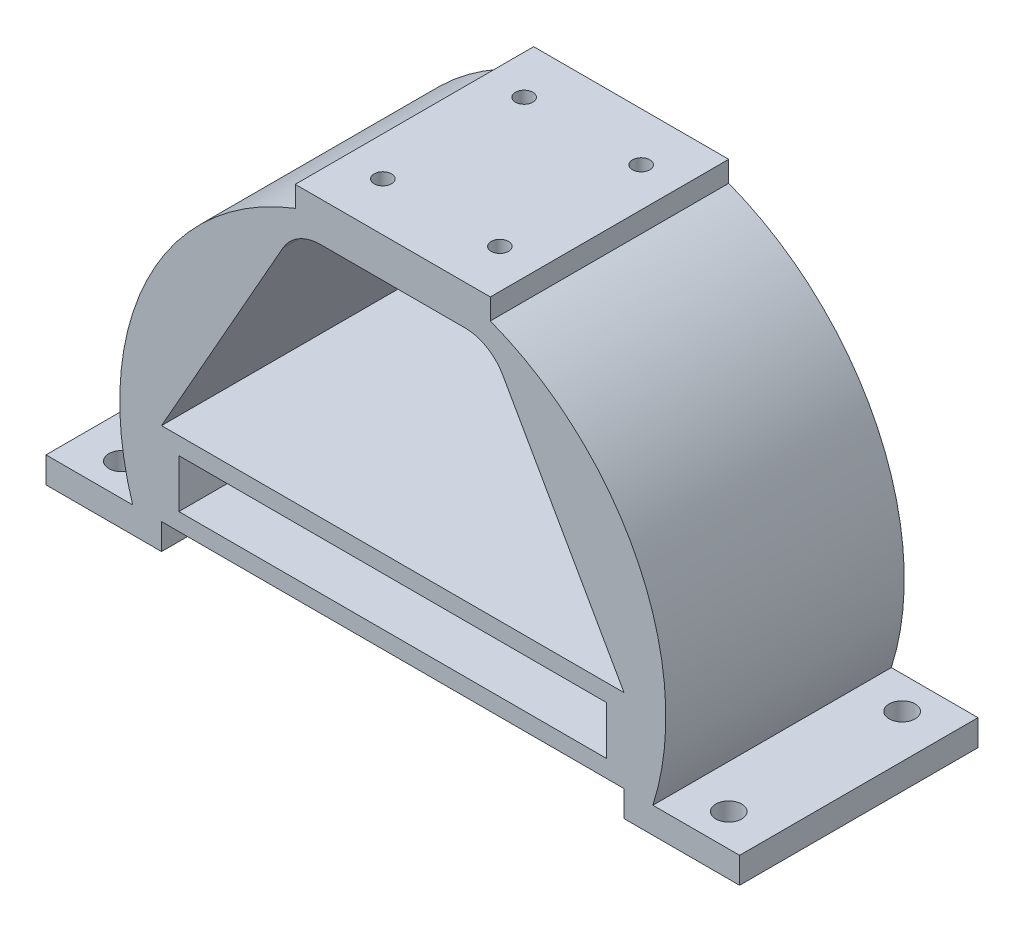
ISO-10303-21;
HEADER;
FILE_DESCRIPTION(('STEP AP214'),'2;1');
FILE_NAME('part.step','',(''),(''),'','','');
FILE_SCHEMA(('AUTOMOTIVE_DESIGN { 1 0 10303 214 1 1 1 1 }'));
ENDSEC;
DATA;
#1=APPLICATION_CONTEXT('core data for automotive mechanical design processes');
#2=APPLICATION_PROTOCOL_DEFINITION('international standard','automotive_design',2000,#1);
#3=PRODUCT_CONTEXT('',#1,'mechanical');
#4=PRODUCT('Part','Part','',(#3));
#5=PRODUCT_RELATED_PRODUCT_CATEGORY('part','',(#4));
#6=PRODUCT_DEFINITION_FORMATION('','',#4);
#7=PRODUCT_DEFINITION_CONTEXT('part definition',#1,'design');
#8=PRODUCT_DEFINITION('design','',#6,#7);
#9=PRODUCT_DEFINITION_SHAPE('','',#8);
#10=(LENGTH_UNIT() NAMED_UNIT(*) SI_UNIT(.MILLI.,.METRE.));
#11=(NAMED_UNIT(*) PLANE_ANGLE_UNIT() SI_UNIT($,.RADIAN.));
#12=(NAMED_UNIT(*) SI_UNIT($,.STERADIAN.) SOLID_ANGLE_UNIT());
#13=UNCERTAINTY_MEASURE_WITH_UNIT(LENGTH_MEASURE(1.E-05),#10,'distance_accuracy_value','');
#14=(GEOMETRIC_REPRESENTATION_CONTEXT(3) GLOBAL_UNCERTAINTY_ASSIGNED_CONTEXT((#13)) GLOBAL_UNIT_ASSIGNED_CONTEXT((#10,
#11,#12)) REPRESENTATION_CONTEXT('',''));
#15=CARTESIAN_POINT('',(0.,0.,0.));
#16=DIRECTION('',(0.,0.,1.));
#17=DIRECTION('',(1.,0.,0.));
#18=AXIS2_PLACEMENT_3D('',#15,#16,#17);
#19=CARTESIAN_POINT('',(65.0241088484073,36.786928366555,69.85));
#20=DIRECTION('',(0.870366838407771,0.492403865338262,0.));
#21=DIRECTION('',(-0.492403865338262,0.870366838407771,0.));
#22=AXIS2_PLACEMENT_3D('',#19,#20,#21);
#23=PLANE('',#22);
#24=DIRECTION('',(0.492403865338262,-0.870366838407771,0.));
#25=VECTOR('',#24,1.);
#26=CARTESIAN_POINT('',(65.0241088484073,36.786928366555,69.85));
#27=LINE('',#26,#25);
#28=CARTESIAN_POINT('',(32.2220451927857,94.7674408013655,69.85));
#29=VERTEX_POINT('',#28);
#30=CARTESIAN_POINT('',(67.7528149977766,31.9637019230769,69.85));
#31=VERTEX_POINT('',#30);
#32=EDGE_CURVE('E262',#29,#31,#27,.T.);
#33=ORIENTED_EDGE('',*,*,#32,.F.);
#34=DIRECTION('',(0.,0.,-1.));
#35=VECTOR('',#34,1.);
#36=CARTESIAN_POINT('',(32.2220451927857,94.7674408013655,0.));
#37=LINE('',#36,#35);
#38=CARTESIAN_POINT('',(32.2220451927857,94.7674408013655,0.));
#39=VERTEX_POINT('',#38);
#40=EDGE_CURVE('E427',#29,#39,#37,.T.);
#41=ORIENTED_EDGE('',*,*,#40,.T.);
#42=DIRECTION('',(0.492403865338262,-0.870366838407771,0.));
#43=VECTOR('',#42,1.);
#44=CARTESIAN_POINT('',(65.0241088484073,36.786928366555,0.));
#45=LINE('',#44,#43);
#46=CARTESIAN_POINT('',(67.7528149977766,31.9637019230769,0.));
#47=VERTEX_POINT('',#46);
#48=EDGE_CURVE('E322',#39,#47,#45,.T.);
#49=ORIENTED_EDGE('',*,*,#48,.T.);
#50=DIRECTION('',(0.,0.,-1.));
#51=VECTOR('',#50,1.);
#52=CARTESIAN_POINT('',(67.7528149977766,31.9637019230769,69.85));
#53=LINE('',#52,#51);
#54=EDGE_CURVE('E423',#31,#47,#53,.T.);
#55=ORIENTED_EDGE('',*,*,#54,.F.);
#56=EDGE_LOOP('',(#33,#41,#49,#55));
#57=FACE_BOUND('',#56,.T.);
#58=ADVANCED_FACE('F41',(#57),#23,.F.);
#59=CARTESIAN_POINT('',(67.7528149977765,0.,69.85));
#60=DIRECTION('',(1.,0.,0.));
#61=DIRECTION('',(0.,1.,0.));
#62=AXIS2_PLACEMENT_3D('',#59,#60,#61);
#63=PLANE('',#62);
#64=DIRECTION('',(0.,-1.,0.));
#65=VECTOR('',#64,1.);
#66=CARTESIAN_POINT('',(67.7528149977765,0.,69.85));
#67=LINE('',#66,#65);
#68=CARTESIAN_POINT('',(67.7528149977765,7.62,69.85));
#69=VERTEX_POINT('',#68);
#70=CARTESIAN_POINT('',(67.7528149977765,0.,69.85));
#71=VERTEX_POINT('',#70);
#72=EDGE_CURVE('E265',#69,#71,#67,.T.);
#73=ORIENTED_EDGE('',*,*,#72,.F.);
#74=DIRECTION('',(0.,0.,1.));
#75=VECTOR('',#74,1.);
#76=CARTESIAN_POINT('',(67.7528149977766,7.62,-137.674949006024));
#77=LINE('',#76,#75);
#78=CARTESIAN_POINT('',(67.7528149977766,7.62,0.));
#79=VERTEX_POINT('',#78);
#80=EDGE_CURVE('E251',#79,#69,#77,.T.);
#81=ORIENTED_EDGE('',*,*,#80,.F.);
#82=DIRECTION('',(0.,-1.,0.));
#83=VECTOR('',#82,1.);
#84=CARTESIAN_POINT('',(67.7528149977765,0.,0.));
#85=LINE('',#84,#83);
#86=CARTESIAN_POINT('',(67.7528149977765,0.,0.));
#87=VERTEX_POINT('',#86);
#88=EDGE_CURVE('E325',#79,#87,#85,.T.);
#89=ORIENTED_EDGE('',*,*,#88,.T.);
#90=DIRECTION('',(0.,0.,-1.));
#91=VECTOR('',#90,1.);
#92=CARTESIAN_POINT('',(67.7528149977765,0.,69.85));
#93=LINE('',#92,#91);
#94=EDGE_CURVE('E419',#71,#87,#93,.T.);
#95=ORIENTED_EDGE('',*,*,#94,.F.);
#96=EDGE_LOOP('',(#73,#81,#89,#95));
#97=FACE_BOUND('',#96,.T.);
#98=ADVANCED_FACE('F567',(#97),#63,.F.);
#99=CARTESIAN_POINT('',(0.,0.,69.85));
#100=DIRECTION('',(0.,-1.,0.));
#101=DIRECTION('',(0.,0.,-1.));
#102=AXIS2_PLACEMENT_3D('',#99,#100,#101);
#103=PLANE('',#102);
#104=CARTESIAN_POINT('',(88.9,0.,60.325));
#105=DIRECTION('',(0.,-1.,0.));
#106=DIRECTION('',(0.,0.,-1.));
#107=AXIS2_PLACEMENT_3D('',#104,#105,#106);
#108=CIRCLE('',#107,3.81000000000002);
#109=CARTESIAN_POINT('',(88.9,0.,56.515));
#110=VERTEX_POINT('',#109);
#111=EDGE_CURVE('E483',#110,#110,#108,.T.);
#112=ORIENTED_EDGE('',*,*,#111,.F.);
#113=EDGE_LOOP('',(#112));
#114=FACE_BOUND('',#113,.T.);
#115=CARTESIAN_POINT('',(88.9,0.,9.52500000000003));
#116=DIRECTION('',(0.,-1.,0.));
#117=DIRECTION('',(0.,0.,-1.));
#118=AXIS2_PLACEMENT_3D('',#115,#116,#117);
#119=CIRCLE('',#118,3.81);
#120=CARTESIAN_POINT('',(88.9,0.,5.71500000000003));
#121=VERTEX_POINT('',#120);
#122=EDGE_CURVE('E482',#121,#121,#119,.T.);
#123=ORIENTED_EDGE('',*,*,#122,.F.);
#124=EDGE_LOOP('',(#123));
#125=FACE_BOUND('',#124,.T.);
#126=DIRECTION('',(-1.,0.,0.));
#127=VECTOR('',#126,1.);
#128=CARTESIAN_POINT('',(0.,0.,0.));
#129=LINE('',#128,#127);
#130=CARTESIAN_POINT('',(101.6,0.,0.));
#131=VERTEX_POINT('',#130);
#132=EDGE_CURVE('E329',#131,#87,#129,.T.);
#133=ORIENTED_EDGE('',*,*,#132,.F.);
#134=DIRECTION('',(0.,0.,-1.));
#135=VECTOR('',#134,1.);
#136=CARTESIAN_POINT('',(101.6,0.,69.85));
#137=LINE('',#136,#135);
#138=CARTESIAN_POINT('',(101.6,0.,69.85));
#139=VERTEX_POINT('',#138);
#140=EDGE_CURVE('E416',#139,#131,#137,.T.);
#141=ORIENTED_EDGE('',*,*,#140,.F.);
#142=DIRECTION('',(-1.,0.,0.));
#143=VECTOR('',#142,1.);
#144=CARTESIAN_POINT('',(0.,0.,69.85));
#145=LINE('',#144,#143);
#146=EDGE_CURVE('E269',#139,#71,#145,.T.);
#147=ORIENTED_EDGE('',*,*,#146,.T.);
#148=ORIENTED_EDGE('',*,*,#94,.T.);
#149=EDGE_LOOP('',(#133,#141,#147,#148));
#150=FACE_BOUND('',#149,.T.);
#151=ADVANCED_FACE('F572',(#114,#125,#150),#103,.T.);
#152=CARTESIAN_POINT('',(101.6,0.,69.85));
#153=DIRECTION('',(-1.,0.,0.));
#154=DIRECTION('',(0.,0.,1.));
#155=AXIS2_PLACEMENT_3D('',#152,#153,#154);
#156=PLANE('',#155);
#157=DIRECTION('',(0.,1.,0.));
#158=VECTOR('',#157,1.);
#159=CARTESIAN_POINT('',(101.6,0.,0.));
#160=LINE('',#159,#158);
#161=CARTESIAN_POINT('',(101.6,7.62,0.));
#162=VERTEX_POINT('',#161);
#163=EDGE_CURVE('E333',#131,#162,#160,.T.);
#164=ORIENTED_EDGE('',*,*,#163,.T.);
#165=DIRECTION('',(0.,0.,-1.));
#166=VECTOR('',#165,1.);
#167=CARTESIAN_POINT('',(101.6,7.62,69.85));
#168=LINE('',#167,#166);
#169=CARTESIAN_POINT('',(101.6,7.62,69.85));
#170=VERTEX_POINT('',#169);
#171=EDGE_CURVE('E412',#170,#162,#168,.T.);
#172=ORIENTED_EDGE('',*,*,#171,.F.);
#173=DIRECTION('',(0.,1.,0.));
#174=VECTOR('',#173,1.);
#175=CARTESIAN_POINT('',(101.6,0.,69.85));
#176=LINE('',#175,#174);
#177=EDGE_CURVE('E273',#139,#170,#176,.T.);
#178=ORIENTED_EDGE('',*,*,#177,.F.);
#179=ORIENTED_EDGE('',*,*,#140,.T.);
#180=EDGE_LOOP('',(#164,#172,#178,#179));
#181=FACE_BOUND('',#180,.T.);
#182=ADVANCED_FACE('F578',(#181),#156,.F.);
#183=CARTESIAN_POINT('',(0.,7.62,69.85));
#184=DIRECTION('',(0.,-1.,0.));
#185=DIRECTION('',(0.,0.,-1.));
#186=AXIS2_PLACEMENT_3D('',#183,#184,#185);
#187=PLANE('',#186);
#188=CARTESIAN_POINT('',(88.9,7.62,60.325));
#189=DIRECTION('',(0.,-1.,0.));
#190=DIRECTION('',(0.,0.,-1.));
#191=AXIS2_PLACEMENT_3D('',#188,#189,#190);
#192=CIRCLE('',#191,3.81000000000002);
#193=CARTESIAN_POINT('',(88.9,7.62,56.515));
#194=VERTEX_POINT('',#193);
#195=EDGE_CURVE('E478',#194,#194,#192,.F.);
#196=ORIENTED_EDGE('',*,*,#195,.F.);
#197=EDGE_LOOP('',(#196));
#198=FACE_BOUND('',#197,.T.);
#199=CARTESIAN_POINT('',(88.9,7.62,9.52500000000003));
#200=DIRECTION('',(0.,-1.,0.));
#201=DIRECTION('',(0.,0.,-1.));
#202=AXIS2_PLACEMENT_3D('',#199,#200,#201);
#203=CIRCLE('',#202,3.81);
#204=CARTESIAN_POINT('',(88.9,7.62,5.71500000000003));
#205=VERTEX_POINT('',#204);
#206=EDGE_CURVE('E488',#205,#205,#203,.F.);
#207=ORIENTED_EDGE('',*,*,#206,.F.);
#208=EDGE_LOOP('',(#207));
#209=FACE_BOUND('',#208,.T.);
#210=DIRECTION('',(-1.,0.,0.));
#211=VECTOR('',#210,1.);
#212=CARTESIAN_POINT('',(0.,7.62,0.));
#213=LINE('',#212,#211);
#214=CARTESIAN_POINT('',(76.2,7.62,0.));
#215=VERTEX_POINT('',#214);
#216=EDGE_CURVE('E336',#162,#215,#213,.T.);
#217=ORIENTED_EDGE('',*,*,#216,.T.);
#218=DIRECTION('',(0.,0.,-1.));
#219=VECTOR('',#218,1.);
#220=CARTESIAN_POINT('',(76.2,7.62,69.85));
#221=LINE('',#220,#219);
#222=CARTESIAN_POINT('',(76.2,7.62,69.85));
#223=VERTEX_POINT('',#222);
#224=EDGE_CURVE('E409',#223,#215,#221,.T.);
#225=ORIENTED_EDGE('',*,*,#224,.F.);
#226=DIRECTION('',(-1.,0.,0.));
#227=VECTOR('',#226,1.);
#228=CARTESIAN_POINT('',(0.,7.62,69.85));
#229=LINE('',#228,#227);
#230=EDGE_CURVE('E276',#170,#223,#229,.T.);
#231=ORIENTED_EDGE('',*,*,#230,.F.);
#232=ORIENTED_EDGE('',*,*,#171,.T.);
#233=EDGE_LOOP('',(#217,#225,#231,#232));
#234=FACE_BOUND('',#233,.T.);
#235=ADVANCED_FACE('F582',(#198,#209,#234),#187,.F.);
#236=CARTESIAN_POINT('',(0.,31.9637019230769,69.85));
#237=DIRECTION('',(0.,0.,-1.));
#238=DIRECTION('',(-1.,0.,0.));
#239=AXIS2_PLACEMENT_3D('',#236,#237,#238);
#240=CYLINDRICAL_SURFACE('',#239,79.9940986780876);
#241=CARTESIAN_POINT('',(0.,31.9637019230769,0.));
#242=DIRECTION('',(0.,0.,1.));
#243=DIRECTION('',(1.,0.,0.));
#244=AXIS2_PLACEMENT_3D('',#241,#242,#243);
#245=CIRCLE('',#244,79.9940986780876);
#246=CARTESIAN_POINT('',(28.575,106.68,0.));
#247=VERTEX_POINT('',#246);
#248=EDGE_CURVE('E340',#247,#215,#245,.F.);
#249=ORIENTED_EDGE('',*,*,#248,.F.);
#250=DIRECTION('',(0.,0.,-1.));
#251=VECTOR('',#250,1.);
#252=CARTESIAN_POINT('',(28.575,106.68,69.85));
#253=LINE('',#252,#251);
#254=CARTESIAN_POINT('',(28.575,106.68,69.85));
#255=VERTEX_POINT('',#254);
#256=EDGE_CURVE('E406',#255,#247,#253,.T.);
#257=ORIENTED_EDGE('',*,*,#256,.F.);
#258=CARTESIAN_POINT('',(0.,31.9637019230769,69.85));
#259=DIRECTION('',(0.,0.,1.));
#260=DIRECTION('',(1.,0.,0.));
#261=AXIS2_PLACEMENT_3D('',#258,#259,#260);
#262=CIRCLE('',#261,79.9940986780876);
#263=EDGE_CURVE('E279',#255,#223,#262,.F.);
#264=ORIENTED_EDGE('',*,*,#263,.T.);
#265=ORIENTED_EDGE('',*,*,#224,.T.);
#266=EDGE_LOOP('',(#249,#257,#264,#265));
#267=FACE_BOUND('',#266,.T.);
#268=ADVANCED_FACE('F586',(#267),#240,.T.);
#269=CARTESIAN_POINT('',(28.575,0.,69.85));
#270=DIRECTION('',(1.,0.,0.));
#271=DIRECTION('',(0.,0.,-1.));
#272=AXIS2_PLACEMENT_3D('',#269,#270,#271);
#273=PLANE('',#272);
#274=DIRECTION('',(0.,-1.,0.));
#275=VECTOR('',#274,1.);
#276=CARTESIAN_POINT('',(28.575,0.,0.));
#277=LINE('',#276,#275);
#278=CARTESIAN_POINT('',(28.575,112.776,0.));
#279=VERTEX_POINT('',#278);
#280=EDGE_CURVE('E344',#279,#247,#277,.T.);
#281=ORIENTED_EDGE('',*,*,#280,.F.);
#282=DIRECTION('',(0.,0.,-1.));
#283=VECTOR('',#282,1.);
#284=CARTESIAN_POINT('',(28.575,112.776,69.85));
#285=LINE('',#284,#283);
#286=CARTESIAN_POINT('',(28.575,112.776,69.85));
#287=VERTEX_POINT('',#286);
#288=EDGE_CURVE('E403',#287,#279,#285,.T.);
#289=ORIENTED_EDGE('',*,*,#288,.F.);
#290=DIRECTION('',(0.,-1.,0.));
#291=VECTOR('',#290,1.);
#292=CARTESIAN_POINT('',(28.575,0.,69.85));
#293=LINE('',#292,#291);
#294=EDGE_CURVE('E283',#287,#255,#293,.T.);
#295=ORIENTED_EDGE('',*,*,#294,.T.);
#296=ORIENTED_EDGE('',*,*,#256,.T.);
#297=EDGE_LOOP('',(#281,#289,#295,#296));
#298=FACE_BOUND('',#297,.T.);
#299=ADVANCED_FACE('F590',(#298),#273,.T.);
#300=CARTESIAN_POINT('',(0.,112.776,69.85));
#301=DIRECTION('',(0.,1.,0.));
#302=DIRECTION('',(0.,0.,1.));
#303=AXIS2_PLACEMENT_3D('',#300,#301,#302);
#304=PLANE('',#303);
#305=CARTESIAN_POINT('',(17.145,112.776,55.626));
#306=DIRECTION('',(0.,1.,0.));
#307=DIRECTION('',(0.,0.,1.));
#308=AXIS2_PLACEMENT_3D('',#305,#306,#307);
#309=CIRCLE('',#308,2.54);
#310=CARTESIAN_POINT('',(17.145,112.776,58.166));
#311=VERTEX_POINT('',#310);
#312=EDGE_CURVE('E510',#311,#311,#309,.T.);
#313=ORIENTED_EDGE('',*,*,#312,.F.);
#314=EDGE_LOOP('',(#313));
#315=FACE_BOUND('',#314,.T.);
#316=CARTESIAN_POINT('',(17.145,112.776,14.224));
#317=DIRECTION('',(0.,1.,0.));
#318=DIRECTION('',(0.,0.,1.));
#319=AXIS2_PLACEMENT_3D('',#316,#317,#318);
#320=CIRCLE('',#319,2.54);
#321=CARTESIAN_POINT('',(17.145,112.776,16.764));
#322=VERTEX_POINT('',#321);
#323=EDGE_CURVE('E518',#322,#322,#320,.T.);
#324=ORIENTED_EDGE('',*,*,#323,.F.);
#325=EDGE_LOOP('',(#324));
#326=FACE_BOUND('',#325,.T.);
#327=CARTESIAN_POINT('',(-17.145,112.776,14.224));
#328=DIRECTION('',(0.,1.,0.));
#329=DIRECTION('',(0.,0.,1.));
#330=AXIS2_PLACEMENT_3D('',#327,#328,#329);
#331=CIRCLE('',#330,2.54);
#332=CARTESIAN_POINT('',(-17.145,112.776,16.764));
#333=VERTEX_POINT('',#332);
#334=EDGE_CURVE('E526',#333,#333,#331,.T.);
#335=ORIENTED_EDGE('',*,*,#334,.F.);
#336=EDGE_LOOP('',(#335));
#337=FACE_BOUND('',#336,.T.);
#338=CARTESIAN_POINT('',(-17.145,112.776,55.626));
#339=DIRECTION('',(0.,1.,0.));
#340=DIRECTION('',(0.,0.,1.));
#341=AXIS2_PLACEMENT_3D('',#338,#339,#340);
#342=CIRCLE('',#341,2.54);
#343=CARTESIAN_POINT('',(-17.145,112.776,58.166));
#344=VERTEX_POINT('',#343);
#345=EDGE_CURVE('E502',#344,#344,#342,.T.);
#346=ORIENTED_EDGE('',*,*,#345,.F.);
#347=EDGE_LOOP('',(#346));
#348=FACE_BOUND('',#347,.T.);
#349=DIRECTION('',(1.,0.,0.));
#350=VECTOR('',#349,1.);
#351=CARTESIAN_POINT('',(0.,112.776,0.));
#352=LINE('',#351,#350);
#353=CARTESIAN_POINT('',(-28.575,112.776,0.));
#354=VERTEX_POINT('',#353);
#355=EDGE_CURVE('E348',#354,#279,#352,.T.);
#356=ORIENTED_EDGE('',*,*,#355,.F.);
#357=DIRECTION('',(0.,0.,-1.));
#358=VECTOR('',#357,1.);
#359=CARTESIAN_POINT('',(-28.575,112.776,69.85));
#360=LINE('',#359,#358);
#361=CARTESIAN_POINT('',(-28.575,112.776,69.85));
#362=VERTEX_POINT('',#361);
#363=EDGE_CURVE('E400',#362,#354,#360,.T.);
#364=ORIENTED_EDGE('',*,*,#363,.F.);
#365=DIRECTION('',(1.,0.,0.));
#366=VECTOR('',#365,1.);
#367=CARTESIAN_POINT('',(0.,112.776,69.85));
#368=LINE('',#367,#366);
#369=EDGE_CURVE('E287',#362,#287,#368,.T.);
#370=ORIENTED_EDGE('',*,*,#369,.T.);
#371=ORIENTED_EDGE('',*,*,#288,.T.);
#372=EDGE_LOOP('',(#356,#364,#370,#371));
#373=FACE_BOUND('',#372,.T.);
#374=ADVANCED_FACE('F594',(#315,#326,#337,#348,#373),#304,.T.);
#375=CARTESIAN_POINT('',(-28.575,0.,69.85));
#376=DIRECTION('',(-1.,0.,0.));
#377=DIRECTION('',(0.,0.,1.));
#378=AXIS2_PLACEMENT_3D('',#375,#376,#377);
#379=PLANE('',#378);
#380=DIRECTION('',(0.,1.,0.));
#381=VECTOR('',#380,1.);
#382=CARTESIAN_POINT('',(-28.575,0.,0.));
#383=LINE('',#382,#381);
#384=CARTESIAN_POINT('',(-28.575,106.68,0.));
#385=VERTEX_POINT('',#384);
#386=EDGE_CURVE('E352',#385,#354,#383,.T.);
#387=ORIENTED_EDGE('',*,*,#386,.F.);
#388=DIRECTION('',(0.,0.,-1.));
#389=VECTOR('',#388,1.);
#390=CARTESIAN_POINT('',(-28.575,106.68,69.85));
#391=LINE('',#390,#389);
#392=CARTESIAN_POINT('',(-28.575,106.68,69.85));
#393=VERTEX_POINT('',#392);
#394=EDGE_CURVE('E397',#393,#385,#391,.T.);
#395=ORIENTED_EDGE('',*,*,#394,.F.);
#396=DIRECTION('',(0.,1.,0.));
#397=VECTOR('',#396,1.);
#398=CARTESIAN_POINT('',(-28.575,0.,69.85));
#399=LINE('',#398,#397);
#400=EDGE_CURVE('E291',#393,#362,#399,.T.);
#401=ORIENTED_EDGE('',*,*,#400,.T.);
#402=ORIENTED_EDGE('',*,*,#363,.T.);
#403=EDGE_LOOP('',(#387,#395,#401,#402));
#404=FACE_BOUND('',#403,.T.);
#405=ADVANCED_FACE('F598',(#404),#379,.T.);
#406=CARTESIAN_POINT('',(0.,31.9637019230769,69.85));
#407=DIRECTION('',(0.,0.,-1.));
#408=DIRECTION('',(-1.,0.,0.));
#409=AXIS2_PLACEMENT_3D('',#406,#407,#408);
#410=CYLINDRICAL_SURFACE('',#409,79.9940986780876);
#411=CARTESIAN_POINT('',(0.,31.9637019230769,0.));
#412=DIRECTION('',(0.,0.,1.));
#413=DIRECTION('',(1.,0.,0.));
#414=AXIS2_PLACEMENT_3D('',#411,#412,#413);
#415=CIRCLE('',#414,79.9940986780876);
#416=CARTESIAN_POINT('',(-76.2,7.62,0.));
#417=VERTEX_POINT('',#416);
#418=EDGE_CURVE('E356',#417,#385,#415,.F.);
#419=ORIENTED_EDGE('',*,*,#418,.F.);
#420=DIRECTION('',(0.,0.,-1.));
#421=VECTOR('',#420,1.);
#422=CARTESIAN_POINT('',(-76.2,7.62,69.85));
#423=LINE('',#422,#421);
#424=CARTESIAN_POINT('',(-76.2,7.62,69.85));
#425=VERTEX_POINT('',#424);
#426=EDGE_CURVE('E394',#425,#417,#423,.T.);
#427=ORIENTED_EDGE('',*,*,#426,.F.);
#428=CARTESIAN_POINT('',(0.,31.9637019230769,69.85));
#429=DIRECTION('',(0.,0.,1.));
#430=DIRECTION('',(1.,0.,0.));
#431=AXIS2_PLACEMENT_3D('',#428,#429,#430);
#432=CIRCLE('',#431,79.9940986780876);
#433=EDGE_CURVE('E295',#425,#393,#432,.F.);
#434=ORIENTED_EDGE('',*,*,#433,.T.);
#435=ORIENTED_EDGE('',*,*,#394,.T.);
#436=EDGE_LOOP('',(#419,#427,#434,#435));
#437=FACE_BOUND('',#436,.T.);
#438=ADVANCED_FACE('F602',(#437),#410,.T.);
#439=CARTESIAN_POINT('',(0.,7.62,69.85));
#440=DIRECTION('',(0.,1.,0.));
#441=DIRECTION('',(0.,0.,1.));
#442=AXIS2_PLACEMENT_3D('',#439,#440,#441);
#443=PLANE('',#442);
#444=CARTESIAN_POINT('',(-88.9,7.62,9.52500000000001));
#445=DIRECTION('',(0.,1.,0.));
#446=DIRECTION('',(0.,0.,1.));
#447=AXIS2_PLACEMENT_3D('',#444,#445,#446);
#448=CIRCLE('',#447,3.81);
#449=CARTESIAN_POINT('',(-88.9,7.62,13.335));
#450=VERTEX_POINT('',#449);
#451=EDGE_CURVE('E492',#450,#450,#448,.F.);
#452=ORIENTED_EDGE('',*,*,#451,.T.);
#453=EDGE_LOOP('',(#452));
#454=FACE_BOUND('',#453,.T.);
#455=CARTESIAN_POINT('',(-88.9,7.62,60.325));
#456=DIRECTION('',(0.,1.,0.));
#457=DIRECTION('',(0.,0.,1.));
#458=AXIS2_PLACEMENT_3D('',#455,#456,#457);
#459=CIRCLE('',#458,3.81);
#460=CARTESIAN_POINT('',(-88.9,7.62,64.135));
#461=VERTEX_POINT('',#460);
#462=EDGE_CURVE('E469',#461,#461,#459,.F.);
#463=ORIENTED_EDGE('',*,*,#462,.T.);
#464=EDGE_LOOP('',(#463));
#465=FACE_BOUND('',#464,.T.);
#466=DIRECTION('',(1.,0.,0.));
#467=VECTOR('',#466,1.);
#468=CARTESIAN_POINT('',(0.,7.62,0.));
#469=LINE('',#468,#467);
#470=CARTESIAN_POINT('',(-101.6,7.62,0.));
#471=VERTEX_POINT('',#470);
#472=EDGE_CURVE('E360',#471,#417,#469,.T.);
#473=ORIENTED_EDGE('',*,*,#472,.F.);
#474=DIRECTION('',(0.,0.,-1.));
#475=VECTOR('',#474,1.);
#476=CARTESIAN_POINT('',(-101.6,7.62,69.85));
#477=LINE('',#476,#475);
#478=CARTESIAN_POINT('',(-101.6,7.62,69.85));
#479=VERTEX_POINT('',#478);
#480=EDGE_CURVE('E391',#479,#471,#477,.T.);
#481=ORIENTED_EDGE('',*,*,#480,.F.);
#482=DIRECTION('',(1.,0.,0.));
#483=VECTOR('',#482,1.);
#484=CARTESIAN_POINT('',(0.,7.62,69.85));
#485=LINE('',#484,#483);
#486=EDGE_CURVE('E299',#479,#425,#485,.T.);
#487=ORIENTED_EDGE('',*,*,#486,.T.);
#488=ORIENTED_EDGE('',*,*,#426,.T.);
#489=EDGE_LOOP('',(#473,#481,#487,#488));
#490=FACE_BOUND('',#489,.T.);
#491=ADVANCED_FACE('F606',(#454,#465,#490),#443,.T.);
#492=CARTESIAN_POINT('',(-101.6,0.,69.85));
#493=DIRECTION('',(-1.,0.,0.));
#494=DIRECTION('',(0.,0.,1.));
#495=AXIS2_PLACEMENT_3D('',#492,#493,#494);
#496=PLANE('',#495);
#497=DIRECTION('',(0.,1.,0.));
#498=VECTOR('',#497,1.);
#499=CARTESIAN_POINT('',(-101.6,0.,0.));
#500=LINE('',#499,#498);
#501=CARTESIAN_POINT('',(-101.6,0.,0.));
#502=VERTEX_POINT('',#501);
#503=EDGE_CURVE('E364',#502,#471,#500,.T.);
#504=ORIENTED_EDGE('',*,*,#503,.F.);
#505=DIRECTION('',(0.,0.,-1.));
#506=VECTOR('',#505,1.);
#507=CARTESIAN_POINT('',(-101.6,0.,69.85));
#508=LINE('',#507,#506);
#509=CARTESIAN_POINT('',(-101.6,0.,69.85));
#510=VERTEX_POINT('',#509);
#511=EDGE_CURVE('E388',#510,#502,#508,.T.);
#512=ORIENTED_EDGE('',*,*,#511,.F.);
#513=DIRECTION('',(0.,1.,0.));
#514=VECTOR('',#513,1.);
#515=CARTESIAN_POINT('',(-101.6,0.,69.85));
#516=LINE('',#515,#514);
#517=EDGE_CURVE('E303',#510,#479,#516,.T.);
#518=ORIENTED_EDGE('',*,*,#517,.T.);
#519=ORIENTED_EDGE('',*,*,#480,.T.);
#520=EDGE_LOOP('',(#504,#512,#518,#519));
#521=FACE_BOUND('',#520,.T.);
#522=ADVANCED_FACE('F610',(#521),#496,.T.);
#523=CARTESIAN_POINT('',(0.,0.,69.85));
#524=DIRECTION('',(0.,1.,0.));
#525=DIRECTION('',(0.,0.,1.));
#526=AXIS2_PLACEMENT_3D('',#523,#524,#525);
#527=PLANE('',#526);
#528=CARTESIAN_POINT('',(-88.9,0.,9.52500000000001));
#529=DIRECTION('',(0.,-1.,0.));
#530=DIRECTION('',(0.,0.,-1.));
#531=AXIS2_PLACEMENT_3D('',#528,#529,#530);
#532=CIRCLE('',#531,3.81);
#533=CARTESIAN_POINT('',(-88.9,0.,5.71500000000001));
#534=VERTEX_POINT('',#533);
#535=EDGE_CURVE('E475',#534,#534,#532,.T.);
#536=ORIENTED_EDGE('',*,*,#535,.F.);
#537=EDGE_LOOP('',(#536));
#538=FACE_BOUND('',#537,.T.);
#539=CARTESIAN_POINT('',(-88.9,0.,60.325));
#540=DIRECTION('',(0.,-1.,0.));
#541=DIRECTION('',(0.,0.,-1.));
#542=AXIS2_PLACEMENT_3D('',#539,#540,#541);
#543=CIRCLE('',#542,3.81);
#544=CARTESIAN_POINT('',(-88.9,0.,56.515));
#545=VERTEX_POINT('',#544);
#546=EDGE_CURVE('E465',#545,#545,#543,.T.);
#547=ORIENTED_EDGE('',*,*,#546,.F.);
#548=EDGE_LOOP('',(#547));
#549=FACE_BOUND('',#548,.T.);
#550=DIRECTION('',(1.,0.,0.));
#551=VECTOR('',#550,1.);
#552=CARTESIAN_POINT('',(0.,0.,0.));
#553=LINE('',#552,#551);
#554=CARTESIAN_POINT('',(-67.7528149977765,0.,0.));
#555=VERTEX_POINT('',#554);
#556=EDGE_CURVE('E368',#502,#555,#553,.T.);
#557=ORIENTED_EDGE('',*,*,#556,.T.);
#558=DIRECTION('',(0.,0.,-1.));
#559=VECTOR('',#558,1.);
#560=CARTESIAN_POINT('',(-67.7528149977765,0.,69.85));
#561=LINE('',#560,#559);
#562=CARTESIAN_POINT('',(-67.7528149977765,0.,69.85));
#563=VERTEX_POINT('',#562);
#564=EDGE_CURVE('E384',#563,#555,#561,.T.);
#565=ORIENTED_EDGE('',*,*,#564,.F.);
#566=DIRECTION('',(1.,0.,0.));
#567=VECTOR('',#566,1.);
#568=CARTESIAN_POINT('',(0.,0.,69.85));
#569=LINE('',#568,#567);
#570=EDGE_CURVE('E307',#510,#563,#569,.T.);
#571=ORIENTED_EDGE('',*,*,#570,.F.);
#572=ORIENTED_EDGE('',*,*,#511,.T.);
#573=EDGE_LOOP('',(#557,#565,#571,#572));
#574=FACE_BOUND('',#573,.T.);
#575=ADVANCED_FACE('F614',(#538,#549,#574),#527,.F.);
#576=CARTESIAN_POINT('',(-67.7528149977765,0.,69.85));
#577=DIRECTION('',(1.,0.,0.));
#578=DIRECTION('',(0.,1.,0.));
#579=AXIS2_PLACEMENT_3D('',#576,#577,#578);
#580=PLANE('',#579);
#581=DIRECTION('',(0.,0.,1.));
#582=VECTOR('',#581,1.);
#583=CARTESIAN_POINT('',(-67.7528149977766,7.62,-137.674949006024));
#584=LINE('',#583,#582);
#585=CARTESIAN_POINT('',(-67.7528149977765,7.62,0.));
#586=VERTEX_POINT('',#585);
#587=CARTESIAN_POINT('',(-67.7528149977766,7.62,69.85));
#588=VERTEX_POINT('',#587);
#589=EDGE_CURVE('E250',#586,#588,#584,.T.);
#590=ORIENTED_EDGE('',*,*,#589,.T.);
#591=DIRECTION('',(0.,-1.,0.));
#592=VECTOR('',#591,1.);
#593=CARTESIAN_POINT('',(-67.7528149977765,0.,69.85));
#594=LINE('',#593,#592);
#595=EDGE_CURVE('E311',#588,#563,#594,.T.);
#596=ORIENTED_EDGE('',*,*,#595,.T.);
#597=ORIENTED_EDGE('',*,*,#564,.T.);
#598=DIRECTION('',(0.,-1.,0.));
#599=VECTOR('',#598,1.);
#600=CARTESIAN_POINT('',(-67.7528149977765,0.,0.));
#601=LINE('',#600,#599);
#602=EDGE_CURVE('E372',#586,#555,#601,.T.);
#603=ORIENTED_EDGE('',*,*,#602,.F.);
#604=EDGE_LOOP('',(#590,#596,#597,#603));
#605=FACE_BOUND('',#604,.T.);
#606=ADVANCED_FACE('F618',(#605),#580,.T.);
#607=CARTESIAN_POINT('',(-65.0241088484073,36.786928366555,69.85));
#608=DIRECTION('',(0.870366838407771,-0.492403865338262,0.));
#609=DIRECTION('',(0.492403865338262,0.870366838407771,0.));
#610=AXIS2_PLACEMENT_3D('',#607,#608,#609);
#611=PLANE('',#610);
#612=DIRECTION('',(-0.492403865338262,-0.870366838407771,0.));
#613=VECTOR('',#612,1.);
#614=CARTESIAN_POINT('',(-65.0241088484073,36.786928366555,0.));
#615=LINE('',#614,#613);
#616=CARTESIAN_POINT('',(-32.2220451927857,94.7674408013655,0.));
#617=VERTEX_POINT('',#616);
#618=CARTESIAN_POINT('',(-67.7528149977766,31.9637019230769,0.));
#619=VERTEX_POINT('',#618);
#620=EDGE_CURVE('E375',#617,#619,#615,.T.);
#621=ORIENTED_EDGE('',*,*,#620,.F.);
#622=DIRECTION('',(0.,0.,-1.));
#623=VECTOR('',#622,1.);
#624=CARTESIAN_POINT('',(-32.2220451927857,94.7674408013655,69.85));
#625=LINE('',#624,#623);
#626=CARTESIAN_POINT('',(-32.2220451927857,94.7674408013655,69.85));
#627=VERTEX_POINT('',#626);
#628=EDGE_CURVE('E57',#617,#627,#625,.F.);
#629=ORIENTED_EDGE('',*,*,#628,.T.);
#630=DIRECTION('',(-0.492403865338262,-0.870366838407771,0.));
#631=VECTOR('',#630,1.);
#632=CARTESIAN_POINT('',(-65.0241088484073,36.786928366555,69.85));
#633=LINE('',#632,#631);
#634=CARTESIAN_POINT('',(-67.7528149977766,31.9637019230769,69.85));
#635=VERTEX_POINT('',#634);
#636=EDGE_CURVE('E314',#627,#635,#633,.T.);
#637=ORIENTED_EDGE('',*,*,#636,.T.);
#638=DIRECTION('',(0.,0.,-1.));
#639=VECTOR('',#638,1.);
#640=CARTESIAN_POINT('',(-67.7528149977766,31.9637019230769,69.85));
#641=LINE('',#640,#639);
#642=EDGE_CURVE('E321',#635,#619,#641,.T.);
#643=ORIENTED_EDGE('',*,*,#642,.T.);
#644=EDGE_LOOP('',(#621,#629,#637,#643));
#645=FACE_BOUND('',#644,.T.);
#646=ADVANCED_FACE('F539',(#645),#611,.T.);
#647=CARTESIAN_POINT('',(0.,101.21391171157,69.85));
#648=DIRECTION('',(0.,1.,0.));
#649=DIRECTION('',(0.,0.,1.));
#650=AXIS2_PLACEMENT_3D('',#647,#648,#649);
#651=PLANE('',#650);
#652=CARTESIAN_POINT('',(17.145,101.21391171157,55.626));
#653=DIRECTION('',(0.,1.,0.));
#654=DIRECTION('',(0.,0.,1.));
#655=AXIS2_PLACEMENT_3D('',#652,#653,#654);
#656=CIRCLE('',#655,2.54);
#657=CARTESIAN_POINT('',(17.145,101.21391171157,58.166));
#658=VERTEX_POINT('',#657);
#659=EDGE_CURVE('E514',#658,#658,#656,.F.);
#660=ORIENTED_EDGE('',*,*,#659,.F.);
#661=EDGE_LOOP('',(#660));
#662=FACE_BOUND('',#661,.T.);
#663=CARTESIAN_POINT('',(17.145,101.21391171157,14.224));
#664=DIRECTION('',(0.,1.,0.));
#665=DIRECTION('',(0.,0.,1.));
#666=AXIS2_PLACEMENT_3D('',#663,#664,#665);
#667=CIRCLE('',#666,2.54);
#668=CARTESIAN_POINT('',(17.145,101.21391171157,16.764));
#669=VERTEX_POINT('',#668);
#670=EDGE_CURVE('E522',#669,#669,#667,.F.);
#671=ORIENTED_EDGE('',*,*,#670,.F.);
#672=EDGE_LOOP('',(#671));
#673=FACE_BOUND('',#672,.T.);
#674=CARTESIAN_POINT('',(-17.145,101.21391171157,14.224));
#675=DIRECTION('',(0.,1.,0.));
#676=DIRECTION('',(0.,0.,1.));
#677=AXIS2_PLACEMENT_3D('',#674,#675,#676);
#678=CIRCLE('',#677,2.54);
#679=CARTESIAN_POINT('',(-17.145,101.21391171157,16.764));
#680=VERTEX_POINT('',#679);
#681=EDGE_CURVE('E506',#680,#680,#678,.F.);
#682=ORIENTED_EDGE('',*,*,#681,.F.);
#683=EDGE_LOOP('',(#682));
#684=FACE_BOUND('',#683,.T.);
#685=CARTESIAN_POINT('',(-17.145,101.21391171157,55.626));
#686=DIRECTION('',(0.,1.,0.));
#687=DIRECTION('',(0.,0.,1.));
#688=AXIS2_PLACEMENT_3D('',#685,#686,#687);
#689=CIRCLE('',#688,2.54);
#690=CARTESIAN_POINT('',(-17.145,101.21391171157,58.166));
#691=VERTEX_POINT('',#690);
#692=EDGE_CURVE('E487',#691,#691,#689,.F.);
#693=ORIENTED_EDGE('',*,*,#692,.F.);
#694=EDGE_LOOP('',(#693));
#695=FACE_BOUND('',#694,.T.);
#696=DIRECTION('',(1.,0.,0.));
#697=VECTOR('',#696,1.);
#698=CARTESIAN_POINT('',(0.,101.21391171157,0.));
#699=LINE('',#698,#697);
#700=CARTESIAN_POINT('',(-21.168386345007,101.21391171157,0.));
#701=VERTEX_POINT('',#700);
#702=CARTESIAN_POINT('',(21.168386345007,101.21391171157,0.));
#703=VERTEX_POINT('',#702);
#704=EDGE_CURVE('E266',#701,#703,#699,.T.);
#705=ORIENTED_EDGE('',*,*,#704,.T.);
#706=DIRECTION('',(0.,0.,-1.));
#707=VECTOR('',#706,1.);
#708=CARTESIAN_POINT('',(21.168386345007,101.21391171157,69.85));
#709=LINE('',#708,#707);
#710=CARTESIAN_POINT('',(21.168386345007,101.21391171157,69.85));
#711=VERTEX_POINT('',#710);
#712=EDGE_CURVE('E435',#703,#711,#709,.F.);
#713=ORIENTED_EDGE('',*,*,#712,.T.);
#714=DIRECTION('',(1.,0.,0.));
#715=VECTOR('',#714,1.);
#716=CARTESIAN_POINT('',(0.,101.21391171157,69.85));
#717=LINE('',#716,#715);
#718=CARTESIAN_POINT('',(-21.168386345007,101.21391171157,69.85));
#719=VERTEX_POINT('',#718);
#720=EDGE_CURVE('E317',#719,#711,#717,.T.);
#721=ORIENTED_EDGE('',*,*,#720,.F.);
#722=DIRECTION('',(0.,0.,-1.));
#723=VECTOR('',#722,1.);
#724=CARTESIAN_POINT('',(-21.168386345007,101.21391171157,69.85));
#725=LINE('',#724,#723);
#726=EDGE_CURVE('E431',#719,#701,#725,.T.);
#727=ORIENTED_EDGE('',*,*,#726,.T.);
#728=EDGE_LOOP('',(#705,#713,#721,#727));
#729=FACE_BOUND('',#728,.T.);
#730=ADVANCED_FACE('F536',(#662,#673,#684,#695,#729),#651,.F.);
#731=CARTESIAN_POINT('',(0.,0.,69.85));
#732=DIRECTION('',(0.,0.,1.));
#733=DIRECTION('',(1.,0.,0.));
#734=AXIS2_PLACEMENT_3D('',#731,#732,#733);
#735=PLANE('',#734);
#736=DIRECTION('',(1.,0.,0.));
#737=VECTOR('',#736,1.);
#738=CARTESIAN_POINT('',(-67.7528149977766,7.62,69.85));
#739=LINE('',#738,#737);
#740=EDGE_CURVE('E238',#588,#69,#739,.T.);
#741=ORIENTED_EDGE('',*,*,#740,.T.);
#742=ORIENTED_EDGE('',*,*,#72,.T.);
#743=ORIENTED_EDGE('',*,*,#146,.F.);
#744=ORIENTED_EDGE('',*,*,#177,.T.);
#745=ORIENTED_EDGE('',*,*,#230,.T.);
#746=ORIENTED_EDGE('',*,*,#263,.F.);
#747=ORIENTED_EDGE('',*,*,#294,.F.);
#748=ORIENTED_EDGE('',*,*,#369,.F.);
#749=ORIENTED_EDGE('',*,*,#400,.F.);
#750=ORIENTED_EDGE('',*,*,#433,.F.);
#751=ORIENTED_EDGE('',*,*,#486,.F.);
#752=ORIENTED_EDGE('',*,*,#517,.F.);
#753=ORIENTED_EDGE('',*,*,#570,.T.);
#754=ORIENTED_EDGE('',*,*,#595,.F.);
#755=EDGE_LOOP('',(#741,#742,#743,#744,#745,#746,#747,#748,#749,#750,#751,#752,#753,#754));
#756=FACE_BOUND('',#755,.T.);
#757=ORIENTED_EDGE('',*,*,#720,.T.);
#758=CARTESIAN_POINT('',(21.168386345007,88.5139117115696,69.85));
#759=DIRECTION('',(0.,0.,1.));
#760=DIRECTION('',(1.,0.,0.));
#761=AXIS2_PLACEMENT_3D('',#758,#759,#760);
#762=CIRCLE('',#761,12.7);
#763=EDGE_CURVE('E443',#711,#29,#762,.F.);
#764=ORIENTED_EDGE('',*,*,#763,.T.);
#765=ORIENTED_EDGE('',*,*,#32,.T.);
#766=DIRECTION('',(-1.,0.,0.));
#767=VECTOR('',#766,1.);
#768=CARTESIAN_POINT('',(-67.7528149977766,31.9637019230769,69.85));
#769=LINE('',#768,#767);
#770=EDGE_CURVE('E246',#31,#635,#769,.T.);
#771=ORIENTED_EDGE('',*,*,#770,.T.);
#772=ORIENTED_EDGE('',*,*,#636,.F.);
#773=CARTESIAN_POINT('',(-21.168386345007,88.5139117115696,69.85));
#774=DIRECTION('',(0.,0.,1.));
#775=DIRECTION('',(1.,0.,0.));
#776=AXIS2_PLACEMENT_3D('',#773,#774,#775);
#777=CIRCLE('',#776,12.7);
#778=EDGE_CURVE('E11',#627,#719,#777,.F.);
#779=ORIENTED_EDGE('',*,*,#778,.T.);
#780=EDGE_LOOP('',(#757,#764,#765,#771,#772,#779));
#781=FACE_BOUND('',#780,.T.);
#782=DIRECTION('',(0.,-1.,0.));
#783=VECTOR('',#782,1.);
#784=CARTESIAN_POINT('',(-62.6728149977765,26.8837019230769,69.85));
#785=LINE('',#784,#783);
#786=CARTESIAN_POINT('',(-62.6728149977765,26.8837019230769,69.85));
#787=VERTEX_POINT('',#786);
#788=CARTESIAN_POINT('',(-62.6728149977765,12.7,69.85));
#789=VERTEX_POINT('',#788);
#790=EDGE_CURVE('E224',#787,#789,#785,.T.);
#791=ORIENTED_EDGE('',*,*,#790,.F.);
#792=DIRECTION('',(-1.,0.,0.));
#793=VECTOR('',#792,1.);
#794=CARTESIAN_POINT('',(-62.6728149977765,26.8837019230769,69.85));
#795=LINE('',#794,#793);
#796=CARTESIAN_POINT('',(62.6728149977765,26.8837019230769,69.85));
#797=VERTEX_POINT('',#796);
#798=EDGE_CURVE('E228',#797,#787,#795,.T.);
#799=ORIENTED_EDGE('',*,*,#798,.F.);
#800=DIRECTION('',(0.,1.,0.));
#801=VECTOR('',#800,1.);
#802=CARTESIAN_POINT('',(62.6728149977765,26.8837019230769,69.85));
#803=LINE('',#802,#801);
#804=CARTESIAN_POINT('',(62.6728149977765,12.7,69.85));
#805=VERTEX_POINT('',#804);
#806=EDGE_CURVE('E207',#805,#797,#803,.T.);
#807=ORIENTED_EDGE('',*,*,#806,.F.);
#808=DIRECTION('',(1.,0.,0.));
#809=VECTOR('',#808,1.);
#810=CARTESIAN_POINT('',(-62.6728149977765,12.7,69.85));
#811=LINE('',#810,#809);
#812=EDGE_CURVE('E217',#789,#805,#811,.T.);
#813=ORIENTED_EDGE('',*,*,#812,.F.);
#814=EDGE_LOOP('',(#791,#799,#807,#813));
#815=FACE_BOUND('',#814,.T.);
#816=ADVANCED_FACE('F226',(#756,#781,#815),#735,.T.);
#817=CARTESIAN_POINT('',(0.,0.,0.));
#818=DIRECTION('',(0.,0.,1.));
#819=DIRECTION('',(1.,0.,0.));
#820=AXIS2_PLACEMENT_3D('',#817,#818,#819);
#821=PLANE('',#820);
#822=ORIENTED_EDGE('',*,*,#88,.F.);
#823=DIRECTION('',(-1.,0.,0.));
#824=VECTOR('',#823,1.);
#825=CARTESIAN_POINT('',(-67.7528149977766,7.62,0.));
#826=LINE('',#825,#824);
#827=EDGE_CURVE('E326',#79,#586,#826,.T.);
#828=ORIENTED_EDGE('',*,*,#827,.T.);
#829=ORIENTED_EDGE('',*,*,#602,.T.);
#830=ORIENTED_EDGE('',*,*,#556,.F.);
#831=ORIENTED_EDGE('',*,*,#503,.T.);
#832=ORIENTED_EDGE('',*,*,#472,.T.);
#833=ORIENTED_EDGE('',*,*,#418,.T.);
#834=ORIENTED_EDGE('',*,*,#386,.T.);
#835=ORIENTED_EDGE('',*,*,#355,.T.);
#836=ORIENTED_EDGE('',*,*,#280,.T.);
#837=ORIENTED_EDGE('',*,*,#248,.T.);
#838=ORIENTED_EDGE('',*,*,#216,.F.);
#839=ORIENTED_EDGE('',*,*,#163,.F.);
#840=ORIENTED_EDGE('',*,*,#132,.T.);
#841=EDGE_LOOP('',(#822,#828,#829,#830,#831,#832,#833,#834,#835,#836,#837,#838,#839,#840));
#842=FACE_BOUND('',#841,.T.);
#843=ORIENTED_EDGE('',*,*,#48,.F.);
#844=CARTESIAN_POINT('',(21.168386345007,88.5139117115696,0.));
#845=DIRECTION('',(0.,0.,1.));
#846=DIRECTION('',(1.,0.,0.));
#847=AXIS2_PLACEMENT_3D('',#844,#845,#846);
#848=CIRCLE('',#847,12.7);
#849=EDGE_CURVE('E440',#39,#703,#848,.T.);
#850=ORIENTED_EDGE('',*,*,#849,.T.);
#851=ORIENTED_EDGE('',*,*,#704,.F.);
#852=CARTESIAN_POINT('',(-21.168386345007,88.5139117115696,0.));
#853=DIRECTION('',(0.,0.,1.));
#854=DIRECTION('',(1.,0.,0.));
#855=AXIS2_PLACEMENT_3D('',#852,#853,#854);
#856=CIRCLE('',#855,12.7);
#857=EDGE_CURVE('E50',#701,#617,#856,.T.);
#858=ORIENTED_EDGE('',*,*,#857,.T.);
#859=ORIENTED_EDGE('',*,*,#620,.T.);
#860=DIRECTION('',(1.,0.,0.));
#861=VECTOR('',#860,1.);
#862=CARTESIAN_POINT('',(-67.7528149977766,31.9637019230769,0.));
#863=LINE('',#862,#861);
#864=EDGE_CURVE('E261',#619,#47,#863,.T.);
#865=ORIENTED_EDGE('',*,*,#864,.T.);
#866=EDGE_LOOP('',(#843,#850,#851,#858,#859,#865));
#867=FACE_BOUND('',#866,.T.);
#868=DIRECTION('',(-1.,0.,0.));
#869=VECTOR('',#868,1.);
#870=CARTESIAN_POINT('',(-62.6728149977765,12.7,0.));
#871=LINE('',#870,#869);
#872=CARTESIAN_POINT('',(62.6728149977765,12.7,0.));
#873=VERTEX_POINT('',#872);
#874=CARTESIAN_POINT('',(-62.6728149977765,12.7,0.));
#875=VERTEX_POINT('',#874);
#876=EDGE_CURVE('E255',#873,#875,#871,.T.);
#877=ORIENTED_EDGE('',*,*,#876,.F.);
#878=DIRECTION('',(0.,-1.,0.));
#879=VECTOR('',#878,1.);
#880=CARTESIAN_POINT('',(62.6728149977765,26.8837019230769,0.));
#881=LINE('',#880,#879);
#882=CARTESIAN_POINT('',(62.6728149977765,26.8837019230769,0.));
#883=VERTEX_POINT('',#882);
#884=EDGE_CURVE('E209',#883,#873,#881,.T.);
#885=ORIENTED_EDGE('',*,*,#884,.F.);
#886=DIRECTION('',(1.,0.,0.));
#887=VECTOR('',#886,1.);
#888=CARTESIAN_POINT('',(-62.6728149977765,26.8837019230769,0.));
#889=LINE('',#888,#887);
#890=CARTESIAN_POINT('',(-62.6728149977765,26.8837019230769,0.));
#891=VERTEX_POINT('',#890);
#892=EDGE_CURVE('E451',#891,#883,#889,.T.);
#893=ORIENTED_EDGE('',*,*,#892,.F.);
#894=DIRECTION('',(0.,1.,0.));
#895=VECTOR('',#894,1.);
#896=CARTESIAN_POINT('',(-62.6728149977765,26.8837019230769,0.));
#897=LINE('',#896,#895);
#898=EDGE_CURVE('E455',#875,#891,#897,.T.);
#899=ORIENTED_EDGE('',*,*,#898,.F.);
#900=EDGE_LOOP('',(#877,#885,#893,#899));
#901=FACE_BOUND('',#900,.T.);
#902=ADVANCED_FACE('F625',(#842,#867,#901),#821,.F.);
#903=CARTESIAN_POINT('',(-67.7528149977766,7.62,-137.674949006024));
#904=DIRECTION('',(0.,-1.,0.));
#905=DIRECTION('',(0.,0.,-1.));
#906=AXIS2_PLACEMENT_3D('',#903,#904,#905);
#907=PLANE('',#906);
#908=ORIENTED_EDGE('',*,*,#827,.F.);
#909=ORIENTED_EDGE('',*,*,#80,.T.);
#910=ORIENTED_EDGE('',*,*,#740,.F.);
#911=ORIENTED_EDGE('',*,*,#589,.F.);
#912=EDGE_LOOP('',(#908,#909,#910,#911));
#913=FACE_BOUND('',#912,.T.);
#914=ADVANCED_FACE('F628',(#913),#907,.T.);
#915=CARTESIAN_POINT('',(-67.7528149977766,31.9637019230769,-137.674949006024));
#916=DIRECTION('',(0.,1.,0.));
#917=DIRECTION('',(0.,0.,1.));
#918=AXIS2_PLACEMENT_3D('',#915,#916,#917);
#919=PLANE('',#918);
#920=ORIENTED_EDGE('',*,*,#864,.F.);
#921=ORIENTED_EDGE('',*,*,#642,.F.);
#922=ORIENTED_EDGE('',*,*,#770,.F.);
#923=ORIENTED_EDGE('',*,*,#54,.T.);
#924=EDGE_LOOP('',(#920,#921,#922,#923));
#925=FACE_BOUND('',#924,.T.);
#926=ADVANCED_FACE('F558',(#925),#919,.T.);
#927=CARTESIAN_POINT('',(-62.6728149977765,12.7,-137.674949006024));
#928=DIRECTION('',(0.,-1.,0.));
#929=DIRECTION('',(0.,0.,-1.));
#930=AXIS2_PLACEMENT_3D('',#927,#928,#929);
#931=PLANE('',#930);
#932=DIRECTION('',(0.,0.,1.));
#933=VECTOR('',#932,1.);
#934=CARTESIAN_POINT('',(62.6728149977765,12.7,-137.674949006024));
#935=LINE('',#934,#933);
#936=EDGE_CURVE('E202',#873,#805,#935,.T.);
#937=ORIENTED_EDGE('',*,*,#936,.F.);
#938=ORIENTED_EDGE('',*,*,#876,.T.);
#939=DIRECTION('',(0.,0.,1.));
#940=VECTOR('',#939,1.);
#941=CARTESIAN_POINT('',(-62.6728149977765,12.7,-137.674949006024));
#942=LINE('',#941,#940);
#943=EDGE_CURVE('E214',#875,#789,#942,.T.);
#944=ORIENTED_EDGE('',*,*,#943,.T.);
#945=ORIENTED_EDGE('',*,*,#812,.T.);
#946=EDGE_LOOP('',(#937,#938,#944,#945));
#947=FACE_BOUND('',#946,.T.);
#948=ADVANCED_FACE('F218',(#947),#931,.F.);
#949=CARTESIAN_POINT('',(62.6728149977765,26.8837019230769,-137.674949006024));
#950=DIRECTION('',(1.,0.,0.));
#951=DIRECTION('',(0.,0.,-1.));
#952=AXIS2_PLACEMENT_3D('',#949,#950,#951);
#953=PLANE('',#952);
#954=DIRECTION('',(0.,0.,1.));
#955=VECTOR('',#954,1.);
#956=CARTESIAN_POINT('',(62.6728149977765,26.8837019230769,-137.674949006024));
#957=LINE('',#956,#955);
#958=EDGE_CURVE('E213',#883,#797,#957,.T.);
#959=ORIENTED_EDGE('',*,*,#958,.F.);
#960=ORIENTED_EDGE('',*,*,#884,.T.);
#961=ORIENTED_EDGE('',*,*,#936,.T.);
#962=ORIENTED_EDGE('',*,*,#806,.T.);
#963=EDGE_LOOP('',(#959,#960,#961,#962));
#964=FACE_BOUND('',#963,.T.);
#965=ADVANCED_FACE('F205',(#964),#953,.F.);
#966=CARTESIAN_POINT('',(-62.6728149977765,26.8837019230769,-137.674949006024));
#967=DIRECTION('',(0.,1.,0.));
#968=DIRECTION('',(0.,0.,1.));
#969=AXIS2_PLACEMENT_3D('',#966,#967,#968);
#970=PLANE('',#969);
#971=DIRECTION('',(0.,0.,1.));
#972=VECTOR('',#971,1.);
#973=CARTESIAN_POINT('',(-62.6728149977765,26.8837019230769,-137.674949006024));
#974=LINE('',#973,#972);
#975=EDGE_CURVE('E235',#891,#787,#974,.T.);
#976=ORIENTED_EDGE('',*,*,#975,.F.);
#977=ORIENTED_EDGE('',*,*,#892,.T.);
#978=ORIENTED_EDGE('',*,*,#958,.T.);
#979=ORIENTED_EDGE('',*,*,#798,.T.);
#980=EDGE_LOOP('',(#976,#977,#978,#979));
#981=FACE_BOUND('',#980,.T.);
#982=ADVANCED_FACE('F642',(#981),#970,.F.);
#983=CARTESIAN_POINT('',(-62.6728149977765,26.8837019230769,-137.674949006024));
#984=DIRECTION('',(-1.,0.,0.));
#985=DIRECTION('',(0.,0.,1.));
#986=AXIS2_PLACEMENT_3D('',#983,#984,#985);
#987=PLANE('',#986);
#988=ORIENTED_EDGE('',*,*,#943,.F.);
#989=ORIENTED_EDGE('',*,*,#898,.T.);
#990=ORIENTED_EDGE('',*,*,#975,.T.);
#991=ORIENTED_EDGE('',*,*,#790,.T.);
#992=EDGE_LOOP('',(#988,#989,#990,#991));
#993=FACE_BOUND('',#992,.T.);
#994=ADVANCED_FACE('F638',(#993),#987,.F.);
#995=CARTESIAN_POINT('',(-88.9,112.777,60.325));
#996=DIRECTION('',(0.,-1.,0.));
#997=DIRECTION('',(0.,0.,-1.));
#998=AXIS2_PLACEMENT_3D('',#995,#996,#997);
#999=CYLINDRICAL_SURFACE('',#998,3.81);
#1000=ORIENTED_EDGE('',*,*,#462,.F.);
#1001=EDGE_LOOP('',(#1000));
#1002=FACE_BOUND('',#1001,.T.);
#1003=ORIENTED_EDGE('',*,*,#546,.T.);
#1004=EDGE_LOOP('',(#1003));
#1005=FACE_BOUND('',#1004,.T.);
#1006=ADVANCED_FACE('F641',(#1002,#1005),#999,.F.);
#1007=CARTESIAN_POINT('',(-88.9,112.777,9.52500000000001));
#1008=DIRECTION('',(0.,-1.,0.));
#1009=DIRECTION('',(0.,0.,-1.));
#1010=AXIS2_PLACEMENT_3D('',#1007,#1008,#1009);
#1011=CYLINDRICAL_SURFACE('',#1010,3.81);
#1012=ORIENTED_EDGE('',*,*,#451,.F.);
#1013=EDGE_LOOP('',(#1012));
#1014=FACE_BOUND('',#1013,.T.);
#1015=ORIENTED_EDGE('',*,*,#535,.T.);
#1016=EDGE_LOOP('',(#1015));
#1017=FACE_BOUND('',#1016,.T.);
#1018=ADVANCED_FACE('F652',(#1014,#1017),#1011,.F.);
#1019=CARTESIAN_POINT('',(88.9,112.777,9.52500000000003));
#1020=DIRECTION('',(0.,-1.,0.));
#1021=DIRECTION('',(0.,0.,-1.));
#1022=AXIS2_PLACEMENT_3D('',#1019,#1020,#1021);
#1023=CYLINDRICAL_SURFACE('',#1022,3.81);
#1024=ORIENTED_EDGE('',*,*,#122,.T.);
#1025=EDGE_LOOP('',(#1024));
#1026=FACE_BOUND('',#1025,.T.);
#1027=ORIENTED_EDGE('',*,*,#206,.T.);
#1028=EDGE_LOOP('',(#1027));
#1029=FACE_BOUND('',#1028,.T.);
#1030=ADVANCED_FACE('F658',(#1026,#1029),#1023,.F.);
#1031=CARTESIAN_POINT('',(88.9,112.777,60.325));
#1032=DIRECTION('',(0.,-1.,0.));
#1033=DIRECTION('',(0.,0.,-1.));
#1034=AXIS2_PLACEMENT_3D('',#1031,#1032,#1033);
#1035=CYLINDRICAL_SURFACE('',#1034,3.81000000000002);
#1036=ORIENTED_EDGE('',*,*,#111,.T.);
#1037=EDGE_LOOP('',(#1036));
#1038=FACE_BOUND('',#1037,.T.);
#1039=ORIENTED_EDGE('',*,*,#195,.T.);
#1040=EDGE_LOOP('',(#1039));
#1041=FACE_BOUND('',#1040,.T.);
#1042=ADVANCED_FACE('F654',(#1038,#1041),#1035,.F.);
#1043=CARTESIAN_POINT('',(-17.145,-0.001000000000001,55.626));
#1044=DIRECTION('',(0.,1.,0.));
#1045=DIRECTION('',(0.,0.,1.));
#1046=AXIS2_PLACEMENT_3D('',#1043,#1044,#1045);
#1047=CYLINDRICAL_SURFACE('',#1046,2.54);
#1048=ORIENTED_EDGE('',*,*,#345,.T.);
#1049=EDGE_LOOP('',(#1048));
#1050=FACE_BOUND('',#1049,.T.);
#1051=ORIENTED_EDGE('',*,*,#692,.T.);
#1052=EDGE_LOOP('',(#1051));
#1053=FACE_BOUND('',#1052,.T.);
#1054=ADVANCED_FACE('F657',(#1050,#1053),#1047,.F.);
#1055=CARTESIAN_POINT('',(-17.145,-0.001000000000001,14.224));
#1056=DIRECTION('',(0.,1.,0.));
#1057=DIRECTION('',(0.,0.,1.));
#1058=AXIS2_PLACEMENT_3D('',#1055,#1056,#1057);
#1059=CYLINDRICAL_SURFACE('',#1058,2.54);
#1060=ORIENTED_EDGE('',*,*,#334,.T.);
#1061=EDGE_LOOP('',(#1060));
#1062=FACE_BOUND('',#1061,.T.);
#1063=ORIENTED_EDGE('',*,*,#681,.T.);
#1064=EDGE_LOOP('',(#1063));
#1065=FACE_BOUND('',#1064,.T.);
#1066=ADVANCED_FACE('F534',(#1062,#1065),#1059,.F.);
#1067=CARTESIAN_POINT('',(17.145,-0.001000000000001,14.224));
#1068=DIRECTION('',(0.,1.,0.));
#1069=DIRECTION('',(0.,0.,1.));
#1070=AXIS2_PLACEMENT_3D('',#1067,#1068,#1069);
#1071=CYLINDRICAL_SURFACE('',#1070,2.54);
#1072=ORIENTED_EDGE('',*,*,#323,.T.);
#1073=EDGE_LOOP('',(#1072));
#1074=FACE_BOUND('',#1073,.T.);
#1075=ORIENTED_EDGE('',*,*,#670,.T.);
#1076=EDGE_LOOP('',(#1075));
#1077=FACE_BOUND('',#1076,.T.);
#1078=ADVANCED_FACE('F671',(#1074,#1077),#1071,.F.);
#1079=CARTESIAN_POINT('',(17.145,-0.001000000000001,55.626));
#1080=DIRECTION('',(0.,1.,0.));
#1081=DIRECTION('',(0.,0.,1.));
#1082=AXIS2_PLACEMENT_3D('',#1079,#1080,#1081);
#1083=CYLINDRICAL_SURFACE('',#1082,2.54);
#1084=ORIENTED_EDGE('',*,*,#312,.T.);
#1085=EDGE_LOOP('',(#1084));
#1086=FACE_BOUND('',#1085,.T.);
#1087=ORIENTED_EDGE('',*,*,#659,.T.);
#1088=EDGE_LOOP('',(#1087));
#1089=FACE_BOUND('',#1088,.T.);
#1090=ADVANCED_FACE('F565',(#1086,#1089),#1083,.F.);
#1091=CARTESIAN_POINT('',(21.168386345007,88.5139117115696,69.85));
#1092=DIRECTION('',(0.,0.,1.));
#1093=DIRECTION('',(1.,0.,0.));
#1094=AXIS2_PLACEMENT_3D('',#1091,#1092,#1093);
#1095=CYLINDRICAL_SURFACE('',#1094,12.7);
#1096=ORIENTED_EDGE('',*,*,#763,.F.);
#1097=ORIENTED_EDGE('',*,*,#712,.F.);
#1098=ORIENTED_EDGE('',*,*,#849,.F.);
#1099=ORIENTED_EDGE('',*,*,#40,.F.);
#1100=EDGE_LOOP('',(#1096,#1097,#1098,#1099));
#1101=FACE_BOUND('',#1100,.T.);
#1102=ADVANCED_FACE('F549',(#1101),#1095,.F.);
#1103=CARTESIAN_POINT('',(-21.168386345007,88.5139117115696,69.85));
#1104=DIRECTION('',(0.,0.,-1.));
#1105=DIRECTION('',(-1.,0.,0.));
#1106=AXIS2_PLACEMENT_3D('',#1103,#1104,#1105);
#1107=CYLINDRICAL_SURFACE('',#1106,12.7);
#1108=ORIENTED_EDGE('',*,*,#778,.F.);
#1109=ORIENTED_EDGE('',*,*,#628,.F.);
#1110=ORIENTED_EDGE('',*,*,#857,.F.);
#1111=ORIENTED_EDGE('',*,*,#726,.F.);
#1112=EDGE_LOOP('',(#1108,#1109,#1110,#1111));
#1113=FACE_BOUND('',#1112,.T.);
#1114=ADVANCED_FACE('F43',(#1113),#1107,.F.);
#1115=CLOSED_SHELL('',(#58,#98,#151,#182,#235,#268,#299,#374,#405,#438,#491,#522,#575,#606,#646,
#730,#816,#902,#914,#926,#948,#965,#982,#994,#1006,#1018,#1030,#1042,#1054,#1066,#1078,#1090,
#1102,#1114));
#1116=MANIFOLD_SOLID_BREP('B2',#1115);
#1117=ADVANCED_BREP_SHAPE_REPRESENTATION('',(#18,#1116),#14);
#1118=SHAPE_DEFINITION_REPRESENTATION(#9,#1117);
ENDSEC;
END-ISO-10303-21;
